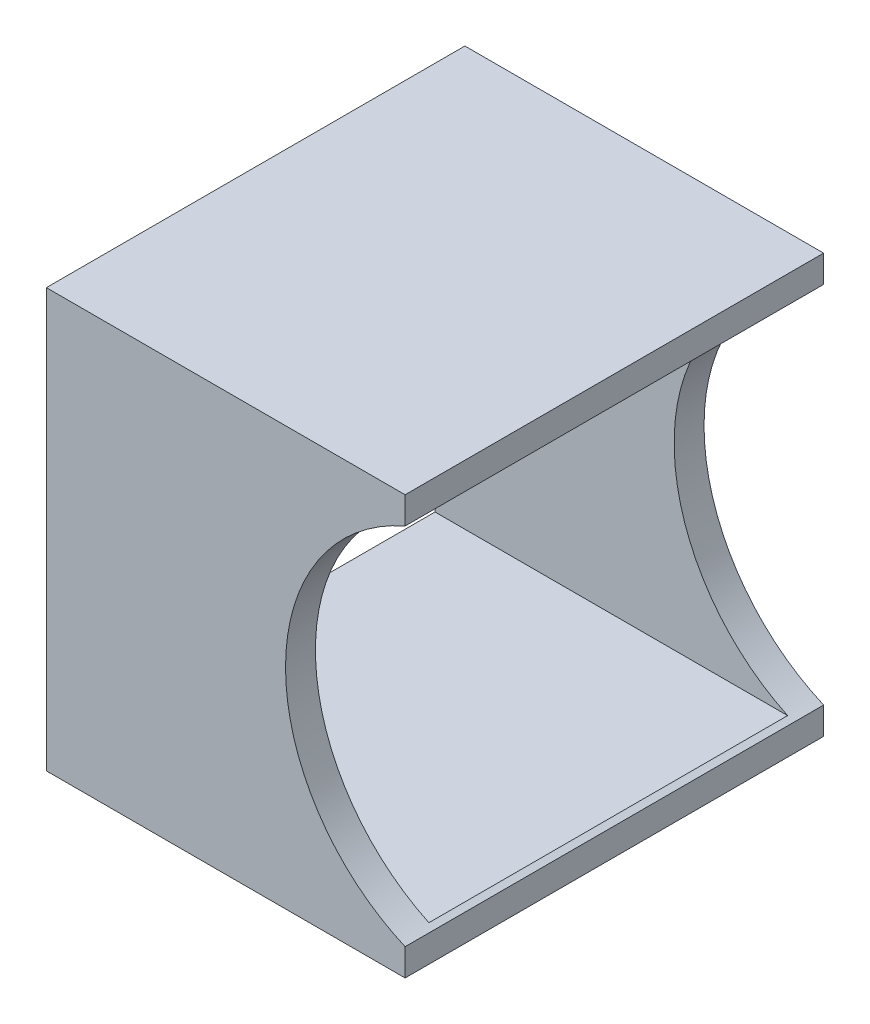
ISO-10303-21;
HEADER;
FILE_DESCRIPTION(('STEP AP214'),'2;1');
FILE_NAME('part.step','',(''),(''),'','','');
FILE_SCHEMA(('AUTOMOTIVE_DESIGN { 1 0 10303 214 1 1 1 1 }'));
ENDSEC;
DATA;
#1=APPLICATION_CONTEXT('core data for automotive mechanical design processes');
#2=APPLICATION_PROTOCOL_DEFINITION('international standard','automotive_design',2000,#1);
#3=PRODUCT_CONTEXT('',#1,'mechanical');
#4=PRODUCT('Part','Part','',(#3));
#5=PRODUCT_RELATED_PRODUCT_CATEGORY('part','',(#4));
#6=PRODUCT_DEFINITION_FORMATION('','',#4);
#7=PRODUCT_DEFINITION_CONTEXT('part definition',#1,'design');
#8=PRODUCT_DEFINITION('design','',#6,#7);
#9=PRODUCT_DEFINITION_SHAPE('','',#8);
#10=(LENGTH_UNIT() NAMED_UNIT(*) SI_UNIT(.MILLI.,.METRE.));
#11=(NAMED_UNIT(*) PLANE_ANGLE_UNIT() SI_UNIT($,.RADIAN.));
#12=(NAMED_UNIT(*) SI_UNIT($,.STERADIAN.) SOLID_ANGLE_UNIT());
#13=UNCERTAINTY_MEASURE_WITH_UNIT(LENGTH_MEASURE(1.E-05),#10,'distance_accuracy_value','');
#14=(GEOMETRIC_REPRESENTATION_CONTEXT(3) GLOBAL_UNCERTAINTY_ASSIGNED_CONTEXT((#13)) GLOBAL_UNIT_ASSIGNED_CONTEXT((#10,
#11,#12)) REPRESENTATION_CONTEXT('',''));
#15=CARTESIAN_POINT('',(0.,0.,0.));
#16=DIRECTION('',(0.,0.,1.));
#17=DIRECTION('',(1.,0.,0.));
#18=AXIS2_PLACEMENT_3D('',#15,#16,#17);
#19=CARTESIAN_POINT('',(38.1,0.,0.));
#20=DIRECTION('',(-1.,0.,0.));
#21=DIRECTION('',(0.,0.,1.));
#22=AXIS2_PLACEMENT_3D('',#19,#20,#21);
#23=PLANE('',#22);
#24=DIRECTION('',(0.,1.,0.));
#25=VECTOR('',#24,1.);
#26=CARTESIAN_POINT('',(38.1,0.,-44.45));
#27=LINE('',#26,#25);
#28=CARTESIAN_POINT('',(38.1,0.,-44.45));
#29=VERTEX_POINT('',#28);
#30=CARTESIAN_POINT('',(38.1,2.88093631110565,-44.45));
#31=VERTEX_POINT('',#30);
#32=EDGE_CURVE('E134',#29,#31,#27,.T.);
#33=ORIENTED_EDGE('',*,*,#32,.T.);
#34=DIRECTION('',(0.,0.,1.));
#35=VECTOR('',#34,1.);
#36=CARTESIAN_POINT('',(38.1,2.88093631110565,-44.45));
#37=LINE('',#36,#35);
#38=CARTESIAN_POINT('',(38.1,2.88093631110565,0.));
#39=VERTEX_POINT('',#38);
#40=EDGE_CURVE('E52',#31,#39,#37,.T.);
#41=ORIENTED_EDGE('',*,*,#40,.T.);
#42=DIRECTION('',(0.,-1.,0.));
#43=VECTOR('',#42,1.);
#44=CARTESIAN_POINT('',(38.1,0.,0.));
#45=LINE('',#44,#43);
#46=CARTESIAN_POINT('',(38.1,0.,0.));
#47=VERTEX_POINT('',#46);
#48=EDGE_CURVE('E153',#39,#47,#45,.T.);
#49=ORIENTED_EDGE('',*,*,#48,.T.);
#50=DIRECTION('',(0.,0.,-1.));
#51=VECTOR('',#50,1.);
#52=CARTESIAN_POINT('',(38.1,0.,0.));
#53=LINE('',#52,#51);
#54=EDGE_CURVE('E135',#47,#29,#53,.T.);
#55=ORIENTED_EDGE('',*,*,#54,.T.);
#56=EDGE_LOOP('',(#33,#41,#49,#55));
#57=FACE_BOUND('',#56,.T.);
#58=ADVANCED_FACE('F37',(#57),#23,.F.);
#59=CARTESIAN_POINT('',(38.1,44.45,0.));
#60=VERTEX_POINT('',#59);
#61=CARTESIAN_POINT('',(38.1,41.5690636888943,0.));
#62=VERTEX_POINT('',#61);
#63=EDGE_CURVE('E127',#60,#62,#45,.T.);
#64=ORIENTED_EDGE('',*,*,#63,.T.);
#65=DIRECTION('',(0.,0.,1.));
#66=VECTOR('',#65,1.);
#67=CARTESIAN_POINT('',(38.1,41.5690636888943,-44.45));
#68=LINE('',#67,#66);
#69=CARTESIAN_POINT('',(38.1,41.5690636888943,-44.45));
#70=VERTEX_POINT('',#69);
#71=EDGE_CURVE('E113',#62,#70,#68,.F.);
#72=ORIENTED_EDGE('',*,*,#71,.T.);
#73=CARTESIAN_POINT('',(38.1,44.45,-44.45));
#74=VERTEX_POINT('',#73);
#75=EDGE_CURVE('E124',#70,#74,#27,.T.);
#76=ORIENTED_EDGE('',*,*,#75,.T.);
#77=DIRECTION('',(0.,0.,1.));
#78=VECTOR('',#77,1.);
#79=CARTESIAN_POINT('',(38.1,44.45,0.));
#80=LINE('',#79,#78);
#81=EDGE_CURVE('E137',#74,#60,#80,.T.);
#82=ORIENTED_EDGE('',*,*,#81,.T.);
#83=EDGE_LOOP('',(#64,#72,#76,#82));
#84=FACE_BOUND('',#83,.T.);
#85=ADVANCED_FACE('F123',(#84),#23,.F.);
#86=CARTESIAN_POINT('',(0.,0.,0.));
#87=DIRECTION('',(-1.,0.,0.));
#88=DIRECTION('',(0.,0.,1.));
#89=AXIS2_PLACEMENT_3D('',#86,#87,#88);
#90=PLANE('',#89);
#91=DIRECTION('',(0.,-1.,0.));
#92=VECTOR('',#91,1.);
#93=CARTESIAN_POINT('',(0.,0.,0.));
#94=LINE('',#93,#92);
#95=CARTESIAN_POINT('',(0.,44.45,0.));
#96=VERTEX_POINT('',#95);
#97=CARTESIAN_POINT('',(0.,0.,0.));
#98=VERTEX_POINT('',#97);
#99=EDGE_CURVE('E143',#96,#98,#94,.T.);
#100=ORIENTED_EDGE('',*,*,#99,.F.);
#101=DIRECTION('',(0.,0.,1.));
#102=VECTOR('',#101,1.);
#103=CARTESIAN_POINT('',(0.,44.45,0.));
#104=LINE('',#103,#102);
#105=CARTESIAN_POINT('',(0.,44.45,-44.45));
#106=VERTEX_POINT('',#105);
#107=EDGE_CURVE('E151',#106,#96,#104,.T.);
#108=ORIENTED_EDGE('',*,*,#107,.F.);
#109=DIRECTION('',(0.,1.,0.));
#110=VECTOR('',#109,1.);
#111=CARTESIAN_POINT('',(0.,0.,-44.45));
#112=LINE('',#111,#110);
#113=CARTESIAN_POINT('',(0.,0.,-44.45));
#114=VERTEX_POINT('',#113);
#115=EDGE_CURVE('E149',#114,#106,#112,.T.);
#116=ORIENTED_EDGE('',*,*,#115,.F.);
#117=DIRECTION('',(0.,0.,-1.));
#118=VECTOR('',#117,1.);
#119=CARTESIAN_POINT('',(0.,0.,0.));
#120=LINE('',#119,#118);
#121=EDGE_CURVE('E146',#98,#114,#120,.T.);
#122=ORIENTED_EDGE('',*,*,#121,.F.);
#123=EDGE_LOOP('',(#100,#108,#116,#122));
#124=FACE_BOUND('',#123,.T.);
#125=DIRECTION('',(0.,0.,1.));
#126=VECTOR('',#125,1.);
#127=CARTESIAN_POINT('',(0.,41.275,-3.175));
#128=LINE('',#127,#126);
#129=CARTESIAN_POINT('',(0.,41.275,-41.275));
#130=VERTEX_POINT('',#129);
#131=CARTESIAN_POINT('',(0.,41.275,-3.175));
#132=VERTEX_POINT('',#131);
#133=EDGE_CURVE('E184',#130,#132,#128,.T.);
#134=ORIENTED_EDGE('',*,*,#133,.T.);
#135=DIRECTION('',(0.,-1.,0.));
#136=VECTOR('',#135,1.);
#137=CARTESIAN_POINT('',(0.,41.275,-3.175));
#138=LINE('',#137,#136);
#139=CARTESIAN_POINT('',(0.,3.175,-3.175));
#140=VERTEX_POINT('',#139);
#141=EDGE_CURVE('E193',#132,#140,#138,.T.);
#142=ORIENTED_EDGE('',*,*,#141,.T.);
#143=DIRECTION('',(0.,0.,-1.));
#144=VECTOR('',#143,1.);
#145=CARTESIAN_POINT('',(0.,3.175,-3.175));
#146=LINE('',#145,#144);
#147=CARTESIAN_POINT('',(0.,3.175,-41.275));
#148=VERTEX_POINT('',#147);
#149=EDGE_CURVE('E190',#140,#148,#146,.T.);
#150=ORIENTED_EDGE('',*,*,#149,.T.);
#151=DIRECTION('',(0.,1.,0.));
#152=VECTOR('',#151,1.);
#153=CARTESIAN_POINT('',(0.,41.275,-41.275));
#154=LINE('',#153,#152);
#155=EDGE_CURVE('E187',#148,#130,#154,.T.);
#156=ORIENTED_EDGE('',*,*,#155,.T.);
#157=EDGE_LOOP('',(#134,#142,#150,#156));
#158=FACE_BOUND('',#157,.T.);
#159=ADVANCED_FACE('F171',(#124,#158),#90,.T.);
#160=CARTESIAN_POINT('',(38.1,0.,0.));
#161=DIRECTION('',(0.,0.,-1.));
#162=DIRECTION('',(-1.,0.,0.));
#163=AXIS2_PLACEMENT_3D('',#160,#161,#162);
#164=PLANE('',#163);
#165=ORIENTED_EDGE('',*,*,#48,.F.);
#166=CARTESIAN_POINT('',(46.482,22.225,0.));
#167=DIRECTION('',(0.,0.,-1.));
#168=DIRECTION('',(-1.,0.,0.));
#169=AXIS2_PLACEMENT_3D('',#166,#167,#168);
#170=CIRCLE('',#169,21.082);
#171=EDGE_CURVE('E128',#39,#62,#170,.T.);
#172=ORIENTED_EDGE('',*,*,#171,.T.);
#173=ORIENTED_EDGE('',*,*,#63,.F.);
#174=DIRECTION('',(-1.,0.,0.));
#175=VECTOR('',#174,1.);
#176=CARTESIAN_POINT('',(38.1,44.45,0.));
#177=LINE('',#176,#175);
#178=EDGE_CURVE('E142',#60,#96,#177,.T.);
#179=ORIENTED_EDGE('',*,*,#178,.T.);
#180=ORIENTED_EDGE('',*,*,#99,.T.);
#181=DIRECTION('',(-1.,0.,0.));
#182=VECTOR('',#181,1.);
#183=CARTESIAN_POINT('',(38.1,0.,0.));
#184=LINE('',#183,#182);
#185=EDGE_CURVE('E45',#47,#98,#184,.T.);
#186=ORIENTED_EDGE('',*,*,#185,.F.);
#187=EDGE_LOOP('',(#165,#172,#173,#179,#180,#186));
#188=FACE_BOUND('',#187,.T.);
#189=ADVANCED_FACE('F39',(#188),#164,.F.);
#190=CARTESIAN_POINT('',(38.1,0.,0.));
#191=DIRECTION('',(0.,1.,0.));
#192=DIRECTION('',(0.,0.,1.));
#193=AXIS2_PLACEMENT_3D('',#190,#191,#192);
#194=PLANE('',#193);
#195=ORIENTED_EDGE('',*,*,#121,.T.);
#196=DIRECTION('',(-1.,0.,0.));
#197=VECTOR('',#196,1.);
#198=CARTESIAN_POINT('',(38.1,0.,-44.45));
#199=LINE('',#198,#197);
#200=EDGE_CURVE('E157',#29,#114,#199,.T.);
#201=ORIENTED_EDGE('',*,*,#200,.F.);
#202=ORIENTED_EDGE('',*,*,#54,.F.);
#203=ORIENTED_EDGE('',*,*,#185,.T.);
#204=EDGE_LOOP('',(#195,#201,#202,#203));
#205=FACE_BOUND('',#204,.T.);
#206=ADVANCED_FACE('F163',(#205),#194,.F.);
#207=CARTESIAN_POINT('',(38.1,0.,-44.45));
#208=DIRECTION('',(0.,0.,1.));
#209=DIRECTION('',(1.,0.,0.));
#210=AXIS2_PLACEMENT_3D('',#207,#208,#209);
#211=PLANE('',#210);
#212=ORIENTED_EDGE('',*,*,#75,.F.);
#213=CARTESIAN_POINT('',(46.482,22.225,-44.45));
#214=DIRECTION('',(0.,0.,1.));
#215=DIRECTION('',(1.,0.,0.));
#216=AXIS2_PLACEMENT_3D('',#213,#214,#215);
#217=CIRCLE('',#216,21.082);
#218=EDGE_CURVE('E110',#70,#31,#217,.T.);
#219=ORIENTED_EDGE('',*,*,#218,.T.);
#220=ORIENTED_EDGE('',*,*,#32,.F.);
#221=ORIENTED_EDGE('',*,*,#200,.T.);
#222=ORIENTED_EDGE('',*,*,#115,.T.);
#223=DIRECTION('',(-1.,0.,0.));
#224=VECTOR('',#223,1.);
#225=CARTESIAN_POINT('',(38.1,44.45,-44.45));
#226=LINE('',#225,#224);
#227=EDGE_CURVE('E132',#74,#106,#226,.T.);
#228=ORIENTED_EDGE('',*,*,#227,.F.);
#229=EDGE_LOOP('',(#212,#219,#220,#221,#222,#228));
#230=FACE_BOUND('',#229,.T.);
#231=ADVANCED_FACE('F130',(#230),#211,.F.);
#232=CARTESIAN_POINT('',(38.1,44.45,0.));
#233=DIRECTION('',(0.,-1.,0.));
#234=DIRECTION('',(0.,0.,-1.));
#235=AXIS2_PLACEMENT_3D('',#232,#233,#234);
#236=PLANE('',#235);
#237=ORIENTED_EDGE('',*,*,#107,.T.);
#238=ORIENTED_EDGE('',*,*,#178,.F.);
#239=ORIENTED_EDGE('',*,*,#81,.F.);
#240=ORIENTED_EDGE('',*,*,#227,.T.);
#241=EDGE_LOOP('',(#237,#238,#239,#240));
#242=FACE_BOUND('',#241,.T.);
#243=ADVANCED_FACE('F175',(#242),#236,.F.);
#244=CARTESIAN_POINT('',(38.1,41.275,-3.175));
#245=DIRECTION('',(0.,0.,-1.));
#246=DIRECTION('',(0.,1.,0.));
#247=AXIS2_PLACEMENT_3D('',#244,#245,#246);
#248=PLANE('',#247);
#249=CARTESIAN_POINT('',(46.482,22.225,-3.175));
#250=DIRECTION('',(0.,0.,-1.));
#251=DIRECTION('',(0.,1.,0.));
#252=AXIS2_PLACEMENT_3D('',#249,#250,#251);
#253=CIRCLE('',#252,21.082);
#254=CARTESIAN_POINT('',(37.4515944720073,3.175,-3.175));
#255=VERTEX_POINT('',#254);
#256=CARTESIAN_POINT('',(37.4515944720073,41.275,-3.175));
#257=VERTEX_POINT('',#256);
#258=EDGE_CURVE('E59',#255,#257,#253,.T.);
#259=ORIENTED_EDGE('',*,*,#258,.F.);
#260=DIRECTION('',(-1.,0.,0.));
#261=VECTOR('',#260,1.);
#262=CARTESIAN_POINT('',(38.1,3.175,-3.175));
#263=LINE('',#262,#261);
#264=EDGE_CURVE('E147',#255,#140,#263,.T.);
#265=ORIENTED_EDGE('',*,*,#264,.T.);
#266=ORIENTED_EDGE('',*,*,#141,.F.);
#267=DIRECTION('',(-1.,0.,0.));
#268=VECTOR('',#267,1.);
#269=CARTESIAN_POINT('',(38.1,41.275,-3.175));
#270=LINE('',#269,#268);
#271=EDGE_CURVE('E182',#257,#132,#270,.T.);
#272=ORIENTED_EDGE('',*,*,#271,.F.);
#273=EDGE_LOOP('',(#259,#265,#266,#272));
#274=FACE_BOUND('',#273,.T.);
#275=ADVANCED_FACE('F216',(#274),#248,.T.);
#276=CARTESIAN_POINT('',(38.1,3.175,-3.175));
#277=DIRECTION('',(0.,1.,0.));
#278=DIRECTION('',(0.,0.,1.));
#279=AXIS2_PLACEMENT_3D('',#276,#277,#278);
#280=PLANE('',#279);
#281=DIRECTION('',(0.,0.,1.));
#282=VECTOR('',#281,1.);
#283=CARTESIAN_POINT('',(37.4515944720073,3.175,-44.45));
#284=LINE('',#283,#282);
#285=CARTESIAN_POINT('',(37.4515944720073,3.175,-41.275));
#286=VERTEX_POINT('',#285);
#287=EDGE_CURVE('E199',#286,#255,#284,.T.);
#288=ORIENTED_EDGE('',*,*,#287,.F.);
#289=DIRECTION('',(-1.,0.,0.));
#290=VECTOR('',#289,1.);
#291=CARTESIAN_POINT('',(38.1,3.175,-41.275));
#292=LINE('',#291,#290);
#293=EDGE_CURVE('E178',#286,#148,#292,.T.);
#294=ORIENTED_EDGE('',*,*,#293,.T.);
#295=ORIENTED_EDGE('',*,*,#149,.F.);
#296=ORIENTED_EDGE('',*,*,#264,.F.);
#297=EDGE_LOOP('',(#288,#294,#295,#296));
#298=FACE_BOUND('',#297,.T.);
#299=ADVANCED_FACE('F208',(#298),#280,.T.);
#300=CARTESIAN_POINT('',(38.1,41.275,-41.275));
#301=DIRECTION('',(0.,0.,1.));
#302=DIRECTION('',(1.,0.,0.));
#303=AXIS2_PLACEMENT_3D('',#300,#301,#302);
#304=PLANE('',#303);
#305=CARTESIAN_POINT('',(46.482,22.225,-41.275));
#306=DIRECTION('',(0.,0.,1.));
#307=DIRECTION('',(1.,0.,0.));
#308=AXIS2_PLACEMENT_3D('',#305,#306,#307);
#309=CIRCLE('',#308,21.082);
#310=CARTESIAN_POINT('',(37.4515944720073,41.275,-41.275));
#311=VERTEX_POINT('',#310);
#312=EDGE_CURVE('E119',#311,#286,#309,.T.);
#313=ORIENTED_EDGE('',*,*,#312,.F.);
#314=DIRECTION('',(-1.,0.,0.));
#315=VECTOR('',#314,1.);
#316=CARTESIAN_POINT('',(38.1,41.275,-41.275));
#317=LINE('',#316,#315);
#318=EDGE_CURVE('E180',#311,#130,#317,.T.);
#319=ORIENTED_EDGE('',*,*,#318,.T.);
#320=ORIENTED_EDGE('',*,*,#155,.F.);
#321=ORIENTED_EDGE('',*,*,#293,.F.);
#322=EDGE_LOOP('',(#313,#319,#320,#321));
#323=FACE_BOUND('',#322,.T.);
#324=ADVANCED_FACE('F211',(#323),#304,.T.);
#325=CARTESIAN_POINT('',(38.1,41.275,-3.175));
#326=DIRECTION('',(0.,-1.,0.));
#327=DIRECTION('',(0.,0.,-1.));
#328=AXIS2_PLACEMENT_3D('',#325,#326,#327);
#329=PLANE('',#328);
#330=DIRECTION('',(0.,0.,1.));
#331=VECTOR('',#330,1.);
#332=CARTESIAN_POINT('',(37.4515944720073,41.275,-44.45));
#333=LINE('',#332,#331);
#334=EDGE_CURVE('E11',#257,#311,#333,.F.);
#335=ORIENTED_EDGE('',*,*,#334,.F.);
#336=ORIENTED_EDGE('',*,*,#271,.T.);
#337=ORIENTED_EDGE('',*,*,#133,.F.);
#338=ORIENTED_EDGE('',*,*,#318,.F.);
#339=EDGE_LOOP('',(#335,#336,#337,#338));
#340=FACE_BOUND('',#339,.T.);
#341=ADVANCED_FACE('F218',(#340),#329,.T.);
#342=CARTESIAN_POINT('',(46.482,22.225,-44.45));
#343=DIRECTION('',(0.,0.,1.));
#344=DIRECTION('',(1.,0.,0.));
#345=AXIS2_PLACEMENT_3D('',#342,#343,#344);
#346=CYLINDRICAL_SURFACE('',#345,21.082);
#347=ORIENTED_EDGE('',*,*,#258,.T.);
#348=ORIENTED_EDGE('',*,*,#334,.T.);
#349=ORIENTED_EDGE('',*,*,#312,.T.);
#350=ORIENTED_EDGE('',*,*,#287,.T.);
#351=EDGE_LOOP('',(#347,#348,#349,#350));
#352=FACE_BOUND('',#351,.T.);
#353=ORIENTED_EDGE('',*,*,#218,.F.);
#354=ORIENTED_EDGE('',*,*,#71,.F.);
#355=ORIENTED_EDGE('',*,*,#171,.F.);
#356=ORIENTED_EDGE('',*,*,#40,.F.);
#357=EDGE_LOOP('',(#353,#354,#355,#356));
#358=FACE_BOUND('',#357,.T.);
#359=ADVANCED_FACE('F112',(#352,#358),#346,.F.);
#360=CLOSED_SHELL('',(#58,#85,#159,#189,#206,#231,#243,#275,#299,#324,#341,#359));
#361=MANIFOLD_SOLID_BREP('B2',#360);
#362=ADVANCED_BREP_SHAPE_REPRESENTATION('',(#18,#361),#14);
#363=SHAPE_DEFINITION_REPRESENTATION(#9,#362);
ENDSEC;
END-ISO-10303-21;
